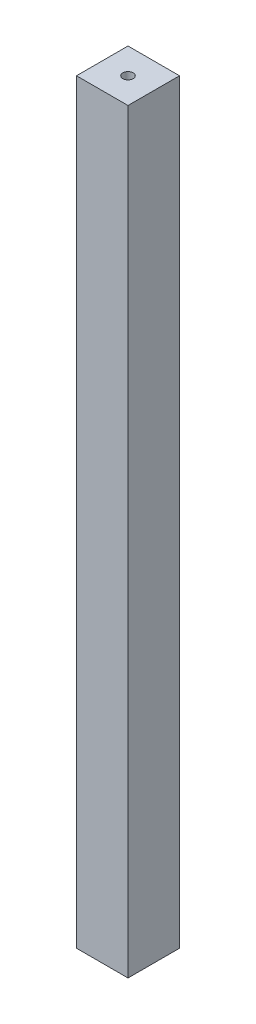
ISO-10303-21;
HEADER;
FILE_DESCRIPTION(('STEP AP214'),'2;1');
FILE_NAME('part.step','',(''),(''),'','','');
FILE_SCHEMA(('AUTOMOTIVE_DESIGN { 1 0 10303 214 1 1 1 1 }'));
ENDSEC;
DATA;
#1=APPLICATION_CONTEXT('core data for automotive mechanical design processes');
#2=APPLICATION_PROTOCOL_DEFINITION('international standard','automotive_design',2000,#1);
#3=PRODUCT_CONTEXT('',#1,'mechanical');
#4=PRODUCT('Part','Part','',(#3));
#5=PRODUCT_RELATED_PRODUCT_CATEGORY('part','',(#4));
#6=PRODUCT_DEFINITION_FORMATION('','',#4);
#7=PRODUCT_DEFINITION_CONTEXT('part definition',#1,'design');
#8=PRODUCT_DEFINITION('design','',#6,#7);
#9=PRODUCT_DEFINITION_SHAPE('','',#8);
#10=(LENGTH_UNIT() NAMED_UNIT(*) SI_UNIT(.MILLI.,.METRE.));
#11=(NAMED_UNIT(*) PLANE_ANGLE_UNIT() SI_UNIT($,.RADIAN.));
#12=(NAMED_UNIT(*) SI_UNIT($,.STERADIAN.) SOLID_ANGLE_UNIT());
#13=UNCERTAINTY_MEASURE_WITH_UNIT(LENGTH_MEASURE(1.E-05),#10,'distance_accuracy_value','');
#14=(GEOMETRIC_REPRESENTATION_CONTEXT(3) GLOBAL_UNCERTAINTY_ASSIGNED_CONTEXT((#13)) GLOBAL_UNIT_ASSIGNED_CONTEXT((#10,
#11,#12)) REPRESENTATION_CONTEXT('',''));
#15=CARTESIAN_POINT('',(0.,0.,0.));
#16=DIRECTION('',(0.,0.,1.));
#17=DIRECTION('',(1.,0.,0.));
#18=AXIS2_PLACEMENT_3D('',#15,#16,#17);
#19=CARTESIAN_POINT('',(0.,220.,0.));
#20=DIRECTION('',(0.,1.,0.));
#21=DIRECTION('',(0.,0.,1.));
#22=AXIS2_PLACEMENT_3D('',#19,#20,#21);
#23=PLANE('',#22);
#24=DIRECTION('',(0.,0.,1.));
#25=VECTOR('',#24,1.);
#26=CARTESIAN_POINT('',(-7.5,220.,-7.5));
#27=LINE('',#26,#25);
#28=CARTESIAN_POINT('',(-7.5,220.,-7.5));
#29=VERTEX_POINT('',#28);
#30=CARTESIAN_POINT('',(-7.5,220.,7.5));
#31=VERTEX_POINT('',#30);
#32=EDGE_CURVE('E93',#29,#31,#27,.T.);
#33=ORIENTED_EDGE('',*,*,#32,.T.);
#34=DIRECTION('',(1.,0.,0.));
#35=VECTOR('',#34,1.);
#36=CARTESIAN_POINT('',(-7.5,220.,7.5));
#37=LINE('',#36,#35);
#38=CARTESIAN_POINT('',(7.5,220.,7.5));
#39=VERTEX_POINT('',#38);
#40=EDGE_CURVE('E88',#31,#39,#37,.T.);
#41=ORIENTED_EDGE('',*,*,#40,.T.);
#42=DIRECTION('',(0.,0.,-1.));
#43=VECTOR('',#42,1.);
#44=CARTESIAN_POINT('',(7.5,220.,-7.5));
#45=LINE('',#44,#43);
#46=CARTESIAN_POINT('',(7.5,220.,-7.5));
#47=VERTEX_POINT('',#46);
#48=EDGE_CURVE('E91',#39,#47,#45,.T.);
#49=ORIENTED_EDGE('',*,*,#48,.T.);
#50=DIRECTION('',(-1.,0.,0.));
#51=VECTOR('',#50,1.);
#52=CARTESIAN_POINT('',(-7.5,220.,-7.5));
#53=LINE('',#52,#51);
#54=EDGE_CURVE('E58',#47,#29,#53,.T.);
#55=ORIENTED_EDGE('',*,*,#54,.T.);
#56=EDGE_LOOP('',(#33,#41,#49,#55));
#57=FACE_BOUND('',#56,.T.);
#58=CARTESIAN_POINT('',(0.,220.,0.));
#59=DIRECTION('',(0.,1.,0.));
#60=DIRECTION('',(0.,0.,1.));
#61=AXIS2_PLACEMENT_3D('',#58,#59,#60);
#62=CIRCLE('',#61,1.5);
#63=CARTESIAN_POINT('',(0.,220.,1.5));
#64=VERTEX_POINT('',#63);
#65=EDGE_CURVE('E108',#64,#64,#62,.T.);
#66=ORIENTED_EDGE('',*,*,#65,.F.);
#67=EDGE_LOOP('',(#66));
#68=FACE_BOUND('',#67,.T.);
#69=ADVANCED_FACE('F41',(#57,#68),#23,.T.);
#70=CARTESIAN_POINT('',(0.,0.,0.));
#71=DIRECTION('',(0.,1.,0.));
#72=DIRECTION('',(0.,0.,1.));
#73=AXIS2_PLACEMENT_3D('',#70,#71,#72);
#74=PLANE('',#73);
#75=DIRECTION('',(0.,0.,1.));
#76=VECTOR('',#75,1.);
#77=CARTESIAN_POINT('',(-7.5,0.,-7.5));
#78=LINE('',#77,#76);
#79=CARTESIAN_POINT('',(-7.5,0.,-7.5));
#80=VERTEX_POINT('',#79);
#81=CARTESIAN_POINT('',(-7.5,0.,7.5));
#82=VERTEX_POINT('',#81);
#83=EDGE_CURVE('E105',#80,#82,#78,.T.);
#84=ORIENTED_EDGE('',*,*,#83,.F.);
#85=DIRECTION('',(-1.,0.,0.));
#86=VECTOR('',#85,1.);
#87=CARTESIAN_POINT('',(-7.5,0.,-7.5));
#88=LINE('',#87,#86);
#89=CARTESIAN_POINT('',(7.5,0.,-7.5));
#90=VERTEX_POINT('',#89);
#91=EDGE_CURVE('E81',#90,#80,#88,.T.);
#92=ORIENTED_EDGE('',*,*,#91,.F.);
#93=DIRECTION('',(0.,0.,-1.));
#94=VECTOR('',#93,1.);
#95=CARTESIAN_POINT('',(7.5,0.,-7.5));
#96=LINE('',#95,#94);
#97=CARTESIAN_POINT('',(7.5,0.,7.5));
#98=VERTEX_POINT('',#97);
#99=EDGE_CURVE('E75',#98,#90,#96,.T.);
#100=ORIENTED_EDGE('',*,*,#99,.F.);
#101=DIRECTION('',(1.,0.,0.));
#102=VECTOR('',#101,1.);
#103=CARTESIAN_POINT('',(-7.5,0.,7.5));
#104=LINE('',#103,#102);
#105=EDGE_CURVE('E97',#82,#98,#104,.T.);
#106=ORIENTED_EDGE('',*,*,#105,.F.);
#107=EDGE_LOOP('',(#84,#92,#100,#106));
#108=FACE_BOUND('',#107,.T.);
#109=CARTESIAN_POINT('',(0.,0.,0.));
#110=DIRECTION('',(0.,1.,0.));
#111=DIRECTION('',(0.,0.,1.));
#112=AXIS2_PLACEMENT_3D('',#109,#110,#111);
#113=CIRCLE('',#112,1.5);
#114=CARTESIAN_POINT('',(0.,0.,1.5));
#115=VERTEX_POINT('',#114);
#116=EDGE_CURVE('E120',#115,#115,#113,.T.);
#117=ORIENTED_EDGE('',*,*,#116,.T.);
#118=EDGE_LOOP('',(#117));
#119=FACE_BOUND('',#118,.T.);
#120=ADVANCED_FACE('F116',(#108,#119),#74,.F.);
#121=CARTESIAN_POINT('',(-7.5,220.,-7.5));
#122=DIRECTION('',(1.,0.,0.));
#123=DIRECTION('',(0.,0.,-1.));
#124=AXIS2_PLACEMENT_3D('',#121,#122,#123);
#125=PLANE('',#124);
#126=ORIENTED_EDGE('',*,*,#83,.T.);
#127=DIRECTION('',(0.,-1.,0.));
#128=VECTOR('',#127,1.);
#129=CARTESIAN_POINT('',(-7.5,220.,7.5));
#130=LINE('',#129,#128);
#131=EDGE_CURVE('E11',#31,#82,#130,.T.);
#132=ORIENTED_EDGE('',*,*,#131,.F.);
#133=ORIENTED_EDGE('',*,*,#32,.F.);
#134=DIRECTION('',(0.,-1.,0.));
#135=VECTOR('',#134,1.);
#136=CARTESIAN_POINT('',(-7.5,220.,-7.5));
#137=LINE('',#136,#135);
#138=EDGE_CURVE('E101',#29,#80,#137,.T.);
#139=ORIENTED_EDGE('',*,*,#138,.T.);
#140=EDGE_LOOP('',(#126,#132,#133,#139));
#141=FACE_BOUND('',#140,.T.);
#142=ADVANCED_FACE('F43',(#141),#125,.F.);
#143=CARTESIAN_POINT('',(-7.5,220.,7.5));
#144=DIRECTION('',(0.,0.,-1.));
#145=DIRECTION('',(-1.,0.,0.));
#146=AXIS2_PLACEMENT_3D('',#143,#144,#145);
#147=PLANE('',#146);
#148=ORIENTED_EDGE('',*,*,#105,.T.);
#149=DIRECTION('',(0.,-1.,0.));
#150=VECTOR('',#149,1.);
#151=CARTESIAN_POINT('',(7.5,220.,7.5));
#152=LINE('',#151,#150);
#153=EDGE_CURVE('E50',#39,#98,#152,.T.);
#154=ORIENTED_EDGE('',*,*,#153,.F.);
#155=ORIENTED_EDGE('',*,*,#40,.F.);
#156=ORIENTED_EDGE('',*,*,#131,.T.);
#157=EDGE_LOOP('',(#148,#154,#155,#156));
#158=FACE_BOUND('',#157,.T.);
#159=ADVANCED_FACE('F96',(#158),#147,.F.);
#160=CARTESIAN_POINT('',(7.5,220.,-7.5));
#161=DIRECTION('',(-1.,0.,0.));
#162=DIRECTION('',(0.,0.,1.));
#163=AXIS2_PLACEMENT_3D('',#160,#161,#162);
#164=PLANE('',#163);
#165=ORIENTED_EDGE('',*,*,#99,.T.);
#166=DIRECTION('',(0.,-1.,0.));
#167=VECTOR('',#166,1.);
#168=CARTESIAN_POINT('',(7.5,220.,-7.5));
#169=LINE('',#168,#167);
#170=EDGE_CURVE('E98',#47,#90,#169,.T.);
#171=ORIENTED_EDGE('',*,*,#170,.F.);
#172=ORIENTED_EDGE('',*,*,#48,.F.);
#173=ORIENTED_EDGE('',*,*,#153,.T.);
#174=EDGE_LOOP('',(#165,#171,#172,#173));
#175=FACE_BOUND('',#174,.T.);
#176=ADVANCED_FACE('F99',(#175),#164,.F.);
#177=CARTESIAN_POINT('',(-7.5,220.,-7.5));
#178=DIRECTION('',(0.,0.,1.));
#179=DIRECTION('',(1.,0.,0.));
#180=AXIS2_PLACEMENT_3D('',#177,#178,#179);
#181=PLANE('',#180);
#182=ORIENTED_EDGE('',*,*,#91,.T.);
#183=ORIENTED_EDGE('',*,*,#138,.F.);
#184=ORIENTED_EDGE('',*,*,#54,.F.);
#185=ORIENTED_EDGE('',*,*,#170,.T.);
#186=EDGE_LOOP('',(#182,#183,#184,#185));
#187=FACE_BOUND('',#186,.T.);
#188=ADVANCED_FACE('F113',(#187),#181,.F.);
#189=CARTESIAN_POINT('',(0.,220.,0.));
#190=DIRECTION('',(0.,-1.,0.));
#191=DIRECTION('',(0.,0.,-1.));
#192=AXIS2_PLACEMENT_3D('',#189,#190,#191);
#193=CYLINDRICAL_SURFACE('',#192,1.5);
#194=ORIENTED_EDGE('',*,*,#65,.T.);
#195=EDGE_LOOP('',(#194));
#196=FACE_BOUND('',#195,.T.);
#197=ORIENTED_EDGE('',*,*,#116,.F.);
#198=EDGE_LOOP('',(#197));
#199=FACE_BOUND('',#198,.T.);
#200=ADVANCED_FACE('F126',(#196,#199),#193,.F.);
#201=CLOSED_SHELL('',(#69,#120,#142,#159,#176,#188,#200));
#202=MANIFOLD_SOLID_BREP('B2',#201);
#203=ADVANCED_BREP_SHAPE_REPRESENTATION('',(#18,#202),#14);
#204=SHAPE_DEFINITION_REPRESENTATION(#9,#203);
ENDSEC;
END-ISO-10303-21;
